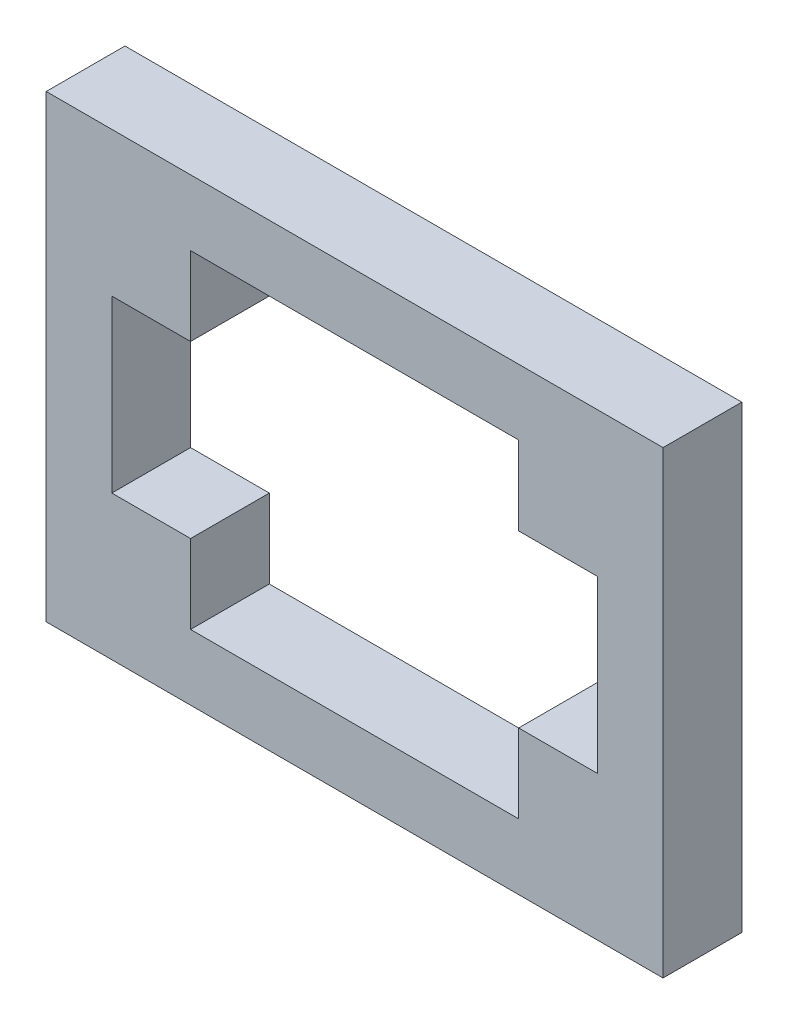
ISO-10303-21;
HEADER;
FILE_DESCRIPTION(('STEP AP214'),'2;1');
FILE_NAME('part.step','',(''),(''),'','','');
FILE_SCHEMA(('AUTOMOTIVE_DESIGN { 1 0 10303 214 1 1 1 1 }'));
ENDSEC;
DATA;
#1=APPLICATION_CONTEXT('core data for automotive mechanical design processes');
#2=APPLICATION_PROTOCOL_DEFINITION('international standard','automotive_design',2000,#1);
#3=PRODUCT_CONTEXT('',#1,'mechanical');
#4=PRODUCT('Part','Part','',(#3));
#5=PRODUCT_RELATED_PRODUCT_CATEGORY('part','',(#4));
#6=PRODUCT_DEFINITION_FORMATION('','',#4);
#7=PRODUCT_DEFINITION_CONTEXT('part definition',#1,'design');
#8=PRODUCT_DEFINITION('design','',#6,#7);
#9=PRODUCT_DEFINITION_SHAPE('','',#8);
#10=(LENGTH_UNIT() NAMED_UNIT(*) SI_UNIT(.MILLI.,.METRE.));
#11=(NAMED_UNIT(*) PLANE_ANGLE_UNIT() SI_UNIT($,.RADIAN.));
#12=(NAMED_UNIT(*) SI_UNIT($,.STERADIAN.) SOLID_ANGLE_UNIT());
#13=UNCERTAINTY_MEASURE_WITH_UNIT(LENGTH_MEASURE(1.E-05),#10,'distance_accuracy_value','');
#14=(GEOMETRIC_REPRESENTATION_CONTEXT(3) GLOBAL_UNCERTAINTY_ASSIGNED_CONTEXT((#13)) GLOBAL_UNIT_ASSIGNED_CONTEXT((#10,
#11,#12)) REPRESENTATION_CONTEXT('',''));
#15=CARTESIAN_POINT('',(0.,0.,0.));
#16=DIRECTION('',(0.,0.,1.));
#17=DIRECTION('',(1.,0.,0.));
#18=AXIS2_PLACEMENT_3D('',#15,#16,#17);
#19=CARTESIAN_POINT('',(0.,0.,6.));
#20=DIRECTION('',(0.,0.,-1.));
#21=DIRECTION('',(-1.,0.,0.));
#22=AXIS2_PLACEMENT_3D('',#19,#20,#21);
#23=PLANE('',#22);
#24=DIRECTION('',(0.,-1.,0.));
#25=VECTOR('',#24,1.);
#26=CARTESIAN_POINT('',(0.,0.,6.));
#27=LINE('',#26,#25);
#28=CARTESIAN_POINT('',(0.,35.,6.));
#29=VERTEX_POINT('',#28);
#30=CARTESIAN_POINT('',(0.,0.,6.));
#31=VERTEX_POINT('',#30);
#32=EDGE_CURVE('E282',#29,#31,#27,.T.);
#33=ORIENTED_EDGE('',*,*,#32,.T.);
#34=DIRECTION('',(1.,0.,0.));
#35=VECTOR('',#34,1.);
#36=CARTESIAN_POINT('',(0.,0.,6.));
#37=LINE('',#36,#35);
#38=CARTESIAN_POINT('',(47.,0.,6.));
#39=VERTEX_POINT('',#38);
#40=EDGE_CURVE('E286',#31,#39,#37,.T.);
#41=ORIENTED_EDGE('',*,*,#40,.T.);
#42=DIRECTION('',(0.,1.,0.));
#43=VECTOR('',#42,1.);
#44=CARTESIAN_POINT('',(47.,0.,6.));
#45=LINE('',#44,#43);
#46=CARTESIAN_POINT('',(47.,35.,6.));
#47=VERTEX_POINT('',#46);
#48=EDGE_CURVE('E290',#39,#47,#45,.T.);
#49=ORIENTED_EDGE('',*,*,#48,.T.);
#50=DIRECTION('',(-1.,0.,0.));
#51=VECTOR('',#50,1.);
#52=CARTESIAN_POINT('',(0.,35.,6.));
#53=LINE('',#52,#51);
#54=EDGE_CURVE('E293',#47,#29,#53,.T.);
#55=ORIENTED_EDGE('',*,*,#54,.T.);
#56=EDGE_LOOP('',(#33,#41,#49,#55));
#57=FACE_BOUND('',#56,.T.);
#58=DIRECTION('',(0.,-1.,0.));
#59=VECTOR('',#58,1.);
#60=CARTESIAN_POINT('',(11.,5.,6.));
#61=LINE('',#60,#59);
#62=CARTESIAN_POINT('',(11.,11.,6.));
#63=VERTEX_POINT('',#62);
#64=CARTESIAN_POINT('',(11.,5.,6.));
#65=VERTEX_POINT('',#64);
#66=EDGE_CURVE('E153',#63,#65,#61,.T.);
#67=ORIENTED_EDGE('',*,*,#66,.F.);
#68=DIRECTION('',(1.,0.,0.));
#69=VECTOR('',#68,1.);
#70=CARTESIAN_POINT('',(5.,11.,6.));
#71=LINE('',#70,#69);
#72=CARTESIAN_POINT('',(5.,11.,6.));
#73=VERTEX_POINT('',#72);
#74=EDGE_CURVE('E206',#73,#63,#71,.T.);
#75=ORIENTED_EDGE('',*,*,#74,.F.);
#76=DIRECTION('',(0.,-1.,0.));
#77=VECTOR('',#76,1.);
#78=CARTESIAN_POINT('',(5.,24.,6.));
#79=LINE('',#78,#77);
#80=CARTESIAN_POINT('',(5.,24.,6.));
#81=VERTEX_POINT('',#80);
#82=EDGE_CURVE('E203',#81,#73,#79,.T.);
#83=ORIENTED_EDGE('',*,*,#82,.F.);
#84=DIRECTION('',(-1.,0.,0.));
#85=VECTOR('',#84,1.);
#86=CARTESIAN_POINT('',(5.,24.,6.));
#87=LINE('',#86,#85);
#88=CARTESIAN_POINT('',(11.,24.,6.));
#89=VERTEX_POINT('',#88);
#90=EDGE_CURVE('E200',#89,#81,#87,.T.);
#91=ORIENTED_EDGE('',*,*,#90,.F.);
#92=DIRECTION('',(0.,-1.,0.));
#93=VECTOR('',#92,1.);
#94=CARTESIAN_POINT('',(11.,30.,6.));
#95=LINE('',#94,#93);
#96=CARTESIAN_POINT('',(11.,30.,6.));
#97=VERTEX_POINT('',#96);
#98=EDGE_CURVE('E197',#97,#89,#95,.T.);
#99=ORIENTED_EDGE('',*,*,#98,.F.);
#100=DIRECTION('',(-1.,0.,0.));
#101=VECTOR('',#100,1.);
#102=CARTESIAN_POINT('',(11.,30.,6.));
#103=LINE('',#102,#101);
#104=CARTESIAN_POINT('',(36.,30.,6.));
#105=VERTEX_POINT('',#104);
#106=EDGE_CURVE('E194',#105,#97,#103,.T.);
#107=ORIENTED_EDGE('',*,*,#106,.F.);
#108=DIRECTION('',(0.,1.,0.));
#109=VECTOR('',#108,1.);
#110=CARTESIAN_POINT('',(36.,30.,6.));
#111=LINE('',#110,#109);
#112=CARTESIAN_POINT('',(36.,24.,6.));
#113=VERTEX_POINT('',#112);
#114=EDGE_CURVE('E191',#113,#105,#111,.T.);
#115=ORIENTED_EDGE('',*,*,#114,.F.);
#116=DIRECTION('',(-1.,0.,0.));
#117=VECTOR('',#116,1.);
#118=CARTESIAN_POINT('',(42.,24.,6.));
#119=LINE('',#118,#117);
#120=CARTESIAN_POINT('',(42.,24.,6.));
#121=VERTEX_POINT('',#120);
#122=EDGE_CURVE('E188',#121,#113,#119,.T.);
#123=ORIENTED_EDGE('',*,*,#122,.F.);
#124=DIRECTION('',(0.,1.,0.));
#125=VECTOR('',#124,1.);
#126=CARTESIAN_POINT('',(42.,24.,6.));
#127=LINE('',#126,#125);
#128=CARTESIAN_POINT('',(42.,11.,6.));
#129=VERTEX_POINT('',#128);
#130=EDGE_CURVE('E185',#129,#121,#127,.T.);
#131=ORIENTED_EDGE('',*,*,#130,.F.);
#132=DIRECTION('',(1.,0.,0.));
#133=VECTOR('',#132,1.);
#134=CARTESIAN_POINT('',(42.,11.,6.));
#135=LINE('',#134,#133);
#136=CARTESIAN_POINT('',(36.,11.,6.));
#137=VERTEX_POINT('',#136);
#138=EDGE_CURVE('E180',#137,#129,#135,.T.);
#139=ORIENTED_EDGE('',*,*,#138,.F.);
#140=DIRECTION('',(0.,1.,0.));
#141=VECTOR('',#140,1.);
#142=CARTESIAN_POINT('',(36.,5.,6.));
#143=LINE('',#142,#141);
#144=CARTESIAN_POINT('',(36.,5.,6.));
#145=VERTEX_POINT('',#144);
#146=EDGE_CURVE('E176',#145,#137,#143,.T.);
#147=ORIENTED_EDGE('',*,*,#146,.F.);
#148=DIRECTION('',(1.,0.,0.));
#149=VECTOR('',#148,1.);
#150=CARTESIAN_POINT('',(11.,5.,6.));
#151=LINE('',#150,#149);
#152=EDGE_CURVE('E162',#65,#145,#151,.T.);
#153=ORIENTED_EDGE('',*,*,#152,.F.);
#154=EDGE_LOOP('',(#67,#75,#83,#91,#99,#107,#115,#123,#131,#139,#147,#153));
#155=FACE_BOUND('',#154,.T.);
#156=ADVANCED_FACE('F39',(#57,#155),#23,.F.);
#157=CARTESIAN_POINT('',(0.,0.,0.));
#158=DIRECTION('',(0.,0.,-1.));
#159=DIRECTION('',(-1.,0.,0.));
#160=AXIS2_PLACEMENT_3D('',#157,#158,#159);
#161=PLANE('',#160);
#162=DIRECTION('',(0.,-1.,0.));
#163=VECTOR('',#162,1.);
#164=CARTESIAN_POINT('',(0.,0.,0.));
#165=LINE('',#164,#163);
#166=CARTESIAN_POINT('',(0.,35.,0.));
#167=VERTEX_POINT('',#166);
#168=CARTESIAN_POINT('',(0.,0.,0.));
#169=VERTEX_POINT('',#168);
#170=EDGE_CURVE('E171',#167,#169,#165,.T.);
#171=ORIENTED_EDGE('',*,*,#170,.F.);
#172=DIRECTION('',(-1.,0.,0.));
#173=VECTOR('',#172,1.);
#174=CARTESIAN_POINT('',(0.,35.,0.));
#175=LINE('',#174,#173);
#176=CARTESIAN_POINT('',(47.,35.,0.));
#177=VERTEX_POINT('',#176);
#178=EDGE_CURVE('E287',#177,#167,#175,.T.);
#179=ORIENTED_EDGE('',*,*,#178,.F.);
#180=DIRECTION('',(0.,1.,0.));
#181=VECTOR('',#180,1.);
#182=CARTESIAN_POINT('',(47.,0.,0.));
#183=LINE('',#182,#181);
#184=CARTESIAN_POINT('',(47.,0.,0.));
#185=VERTEX_POINT('',#184);
#186=EDGE_CURVE('E303',#185,#177,#183,.T.);
#187=ORIENTED_EDGE('',*,*,#186,.F.);
#188=DIRECTION('',(1.,0.,0.));
#189=VECTOR('',#188,1.);
#190=CARTESIAN_POINT('',(0.,0.,0.));
#191=LINE('',#190,#189);
#192=EDGE_CURVE('E300',#169,#185,#191,.T.);
#193=ORIENTED_EDGE('',*,*,#192,.F.);
#194=EDGE_LOOP('',(#171,#179,#187,#193));
#195=FACE_BOUND('',#194,.T.);
#196=DIRECTION('',(1.,0.,0.));
#197=VECTOR('',#196,1.);
#198=CARTESIAN_POINT('',(5.,11.,0.));
#199=LINE('',#198,#197);
#200=CARTESIAN_POINT('',(5.,11.,0.));
#201=VERTEX_POINT('',#200);
#202=CARTESIAN_POINT('',(11.,11.,0.));
#203=VERTEX_POINT('',#202);
#204=EDGE_CURVE('E163',#201,#203,#199,.T.);
#205=ORIENTED_EDGE('',*,*,#204,.T.);
#206=DIRECTION('',(0.,-1.,0.));
#207=VECTOR('',#206,1.);
#208=CARTESIAN_POINT('',(11.,5.,0.));
#209=LINE('',#208,#207);
#210=CARTESIAN_POINT('',(11.,5.,0.));
#211=VERTEX_POINT('',#210);
#212=EDGE_CURVE('E63',#203,#211,#209,.T.);
#213=ORIENTED_EDGE('',*,*,#212,.T.);
#214=DIRECTION('',(1.,0.,0.));
#215=VECTOR('',#214,1.);
#216=CARTESIAN_POINT('',(11.,5.,0.));
#217=LINE('',#216,#215);
#218=CARTESIAN_POINT('',(36.,5.,0.));
#219=VERTEX_POINT('',#218);
#220=EDGE_CURVE('E169',#211,#219,#217,.T.);
#221=ORIENTED_EDGE('',*,*,#220,.T.);
#222=DIRECTION('',(0.,1.,0.));
#223=VECTOR('',#222,1.);
#224=CARTESIAN_POINT('',(36.,5.,0.));
#225=LINE('',#224,#223);
#226=CARTESIAN_POINT('',(36.,11.,0.));
#227=VERTEX_POINT('',#226);
#228=EDGE_CURVE('E213',#219,#227,#225,.T.);
#229=ORIENTED_EDGE('',*,*,#228,.T.);
#230=DIRECTION('',(1.,0.,0.));
#231=VECTOR('',#230,1.);
#232=CARTESIAN_POINT('',(42.,11.,0.));
#233=LINE('',#232,#231);
#234=CARTESIAN_POINT('',(42.,11.,0.));
#235=VERTEX_POINT('',#234);
#236=EDGE_CURVE('E217',#227,#235,#233,.T.);
#237=ORIENTED_EDGE('',*,*,#236,.T.);
#238=DIRECTION('',(0.,1.,0.));
#239=VECTOR('',#238,1.);
#240=CARTESIAN_POINT('',(42.,24.,0.));
#241=LINE('',#240,#239);
#242=CARTESIAN_POINT('',(42.,24.,0.));
#243=VERTEX_POINT('',#242);
#244=EDGE_CURVE('E221',#235,#243,#241,.T.);
#245=ORIENTED_EDGE('',*,*,#244,.T.);
#246=DIRECTION('',(-1.,0.,0.));
#247=VECTOR('',#246,1.);
#248=CARTESIAN_POINT('',(42.,24.,0.));
#249=LINE('',#248,#247);
#250=CARTESIAN_POINT('',(36.,24.,0.));
#251=VERTEX_POINT('',#250);
#252=EDGE_CURVE('E225',#243,#251,#249,.T.);
#253=ORIENTED_EDGE('',*,*,#252,.T.);
#254=DIRECTION('',(0.,1.,0.));
#255=VECTOR('',#254,1.);
#256=CARTESIAN_POINT('',(36.,30.,0.));
#257=LINE('',#256,#255);
#258=CARTESIAN_POINT('',(36.,30.,0.));
#259=VERTEX_POINT('',#258);
#260=EDGE_CURVE('E229',#251,#259,#257,.T.);
#261=ORIENTED_EDGE('',*,*,#260,.T.);
#262=DIRECTION('',(-1.,0.,0.));
#263=VECTOR('',#262,1.);
#264=CARTESIAN_POINT('',(11.,30.,0.));
#265=LINE('',#264,#263);
#266=CARTESIAN_POINT('',(11.,30.,0.));
#267=VERTEX_POINT('',#266);
#268=EDGE_CURVE('E233',#259,#267,#265,.T.);
#269=ORIENTED_EDGE('',*,*,#268,.T.);
#270=DIRECTION('',(0.,-1.,0.));
#271=VECTOR('',#270,1.);
#272=CARTESIAN_POINT('',(11.,30.,0.));
#273=LINE('',#272,#271);
#274=CARTESIAN_POINT('',(11.,24.,0.));
#275=VERTEX_POINT('',#274);
#276=EDGE_CURVE('E237',#267,#275,#273,.T.);
#277=ORIENTED_EDGE('',*,*,#276,.T.);
#278=DIRECTION('',(-1.,0.,0.));
#279=VECTOR('',#278,1.);
#280=CARTESIAN_POINT('',(5.,24.,0.));
#281=LINE('',#280,#279);
#282=CARTESIAN_POINT('',(5.,24.,0.));
#283=VERTEX_POINT('',#282);
#284=EDGE_CURVE('E241',#275,#283,#281,.T.);
#285=ORIENTED_EDGE('',*,*,#284,.T.);
#286=DIRECTION('',(0.,-1.,0.));
#287=VECTOR('',#286,1.);
#288=CARTESIAN_POINT('',(5.,24.,0.));
#289=LINE('',#288,#287);
#290=EDGE_CURVE('E245',#283,#201,#289,.T.);
#291=ORIENTED_EDGE('',*,*,#290,.T.);
#292=EDGE_LOOP('',(#205,#213,#221,#229,#237,#245,#253,#261,#269,#277,#285,#291));
#293=FACE_BOUND('',#292,.T.);
#294=ADVANCED_FACE('F326',(#195,#293),#161,.T.);
#295=CARTESIAN_POINT('',(0.,0.,6.));
#296=DIRECTION('',(1.,0.,0.));
#297=DIRECTION('',(0.,0.,-1.));
#298=AXIS2_PLACEMENT_3D('',#295,#296,#297);
#299=PLANE('',#298);
#300=ORIENTED_EDGE('',*,*,#170,.T.);
#301=DIRECTION('',(0.,0.,-1.));
#302=VECTOR('',#301,1.);
#303=CARTESIAN_POINT('',(0.,0.,6.));
#304=LINE('',#303,#302);
#305=EDGE_CURVE('E11',#31,#169,#304,.T.);
#306=ORIENTED_EDGE('',*,*,#305,.F.);
#307=ORIENTED_EDGE('',*,*,#32,.F.);
#308=DIRECTION('',(0.,0.,-1.));
#309=VECTOR('',#308,1.);
#310=CARTESIAN_POINT('',(0.,35.,6.));
#311=LINE('',#310,#309);
#312=EDGE_CURVE('E296',#29,#167,#311,.T.);
#313=ORIENTED_EDGE('',*,*,#312,.T.);
#314=EDGE_LOOP('',(#300,#306,#307,#313));
#315=FACE_BOUND('',#314,.T.);
#316=ADVANCED_FACE('F41',(#315),#299,.F.);
#317=CARTESIAN_POINT('',(0.,0.,6.));
#318=DIRECTION('',(0.,1.,0.));
#319=DIRECTION('',(0.,0.,1.));
#320=AXIS2_PLACEMENT_3D('',#317,#318,#319);
#321=PLANE('',#320);
#322=ORIENTED_EDGE('',*,*,#192,.T.);
#323=DIRECTION('',(0.,0.,-1.));
#324=VECTOR('',#323,1.);
#325=CARTESIAN_POINT('',(47.,0.,6.));
#326=LINE('',#325,#324);
#327=EDGE_CURVE('E48',#39,#185,#326,.T.);
#328=ORIENTED_EDGE('',*,*,#327,.F.);
#329=ORIENTED_EDGE('',*,*,#40,.F.);
#330=ORIENTED_EDGE('',*,*,#305,.T.);
#331=EDGE_LOOP('',(#322,#328,#329,#330));
#332=FACE_BOUND('',#331,.T.);
#333=ADVANCED_FACE('F336',(#332),#321,.F.);
#334=CARTESIAN_POINT('',(47.,0.,6.));
#335=DIRECTION('',(-1.,0.,0.));
#336=DIRECTION('',(0.,0.,1.));
#337=AXIS2_PLACEMENT_3D('',#334,#335,#336);
#338=PLANE('',#337);
#339=ORIENTED_EDGE('',*,*,#186,.T.);
#340=DIRECTION('',(0.,0.,-1.));
#341=VECTOR('',#340,1.);
#342=CARTESIAN_POINT('',(47.,35.,6.));
#343=LINE('',#342,#341);
#344=EDGE_CURVE('E311',#47,#177,#343,.T.);
#345=ORIENTED_EDGE('',*,*,#344,.F.);
#346=ORIENTED_EDGE('',*,*,#48,.F.);
#347=ORIENTED_EDGE('',*,*,#327,.T.);
#348=EDGE_LOOP('',(#339,#345,#346,#347));
#349=FACE_BOUND('',#348,.T.);
#350=ADVANCED_FACE('F320',(#349),#338,.F.);
#351=CARTESIAN_POINT('',(0.,35.,6.));
#352=DIRECTION('',(0.,-1.,0.));
#353=DIRECTION('',(0.,0.,-1.));
#354=AXIS2_PLACEMENT_3D('',#351,#352,#353);
#355=PLANE('',#354);
#356=ORIENTED_EDGE('',*,*,#178,.T.);
#357=ORIENTED_EDGE('',*,*,#312,.F.);
#358=ORIENTED_EDGE('',*,*,#54,.F.);
#359=ORIENTED_EDGE('',*,*,#344,.T.);
#360=EDGE_LOOP('',(#356,#357,#358,#359));
#361=FACE_BOUND('',#360,.T.);
#362=ADVANCED_FACE('F330',(#361),#355,.F.);
#363=CARTESIAN_POINT('',(11.,5.,6.));
#364=DIRECTION('',(1.,0.,0.));
#365=DIRECTION('',(0.,0.,-1.));
#366=AXIS2_PLACEMENT_3D('',#363,#364,#365);
#367=PLANE('',#366);
#368=ORIENTED_EDGE('',*,*,#212,.F.);
#369=DIRECTION('',(0.,0.,-1.));
#370=VECTOR('',#369,1.);
#371=CARTESIAN_POINT('',(11.,11.,6.));
#372=LINE('',#371,#370);
#373=EDGE_CURVE('E157',#63,#203,#372,.T.);
#374=ORIENTED_EDGE('',*,*,#373,.F.);
#375=ORIENTED_EDGE('',*,*,#66,.T.);
#376=DIRECTION('',(0.,0.,-1.));
#377=VECTOR('',#376,1.);
#378=CARTESIAN_POINT('',(11.,5.,6.));
#379=LINE('',#378,#377);
#380=EDGE_CURVE('E156',#65,#211,#379,.T.);
#381=ORIENTED_EDGE('',*,*,#380,.T.);
#382=EDGE_LOOP('',(#368,#374,#375,#381));
#383=FACE_BOUND('',#382,.T.);
#384=ADVANCED_FACE('F155',(#383),#367,.T.);
#385=CARTESIAN_POINT('',(11.,5.,6.));
#386=DIRECTION('',(0.,1.,0.));
#387=DIRECTION('',(0.,0.,1.));
#388=AXIS2_PLACEMENT_3D('',#385,#386,#387);
#389=PLANE('',#388);
#390=ORIENTED_EDGE('',*,*,#220,.F.);
#391=ORIENTED_EDGE('',*,*,#380,.F.);
#392=ORIENTED_EDGE('',*,*,#152,.T.);
#393=DIRECTION('',(0.,0.,-1.));
#394=VECTOR('',#393,1.);
#395=CARTESIAN_POINT('',(36.,5.,6.));
#396=LINE('',#395,#394);
#397=EDGE_CURVE('E172',#145,#219,#396,.T.);
#398=ORIENTED_EDGE('',*,*,#397,.T.);
#399=EDGE_LOOP('',(#390,#391,#392,#398));
#400=FACE_BOUND('',#399,.T.);
#401=ADVANCED_FACE('F166',(#400),#389,.T.);
#402=CARTESIAN_POINT('',(36.,5.,6.));
#403=DIRECTION('',(-1.,0.,0.));
#404=DIRECTION('',(0.,0.,1.));
#405=AXIS2_PLACEMENT_3D('',#402,#403,#404);
#406=PLANE('',#405);
#407=ORIENTED_EDGE('',*,*,#228,.F.);
#408=ORIENTED_EDGE('',*,*,#397,.F.);
#409=ORIENTED_EDGE('',*,*,#146,.T.);
#410=DIRECTION('',(0.,0.,-1.));
#411=VECTOR('',#410,1.);
#412=CARTESIAN_POINT('',(36.,11.,6.));
#413=LINE('',#412,#411);
#414=EDGE_CURVE('E277',#137,#227,#413,.T.);
#415=ORIENTED_EDGE('',*,*,#414,.T.);
#416=EDGE_LOOP('',(#407,#408,#409,#415));
#417=FACE_BOUND('',#416,.T.);
#418=ADVANCED_FACE('F359',(#417),#406,.T.);
#419=CARTESIAN_POINT('',(42.,11.,6.));
#420=DIRECTION('',(0.,1.,0.));
#421=DIRECTION('',(-1.,0.,0.));
#422=AXIS2_PLACEMENT_3D('',#419,#420,#421);
#423=PLANE('',#422);
#424=ORIENTED_EDGE('',*,*,#236,.F.);
#425=ORIENTED_EDGE('',*,*,#414,.F.);
#426=ORIENTED_EDGE('',*,*,#138,.T.);
#427=DIRECTION('',(0.,0.,-1.));
#428=VECTOR('',#427,1.);
#429=CARTESIAN_POINT('',(42.,11.,6.));
#430=LINE('',#429,#428);
#431=EDGE_CURVE('E274',#129,#235,#430,.T.);
#432=ORIENTED_EDGE('',*,*,#431,.T.);
#433=EDGE_LOOP('',(#424,#425,#426,#432));
#434=FACE_BOUND('',#433,.T.);
#435=ADVANCED_FACE('F363',(#434),#423,.T.);
#436=CARTESIAN_POINT('',(42.,24.,6.));
#437=DIRECTION('',(-1.,0.,0.));
#438=DIRECTION('',(0.,-1.,0.));
#439=AXIS2_PLACEMENT_3D('',#436,#437,#438);
#440=PLANE('',#439);
#441=ORIENTED_EDGE('',*,*,#244,.F.);
#442=ORIENTED_EDGE('',*,*,#431,.F.);
#443=ORIENTED_EDGE('',*,*,#130,.T.);
#444=DIRECTION('',(0.,0.,-1.));
#445=VECTOR('',#444,1.);
#446=CARTESIAN_POINT('',(42.,24.,6.));
#447=LINE('',#446,#445);
#448=EDGE_CURVE('E271',#121,#243,#447,.T.);
#449=ORIENTED_EDGE('',*,*,#448,.T.);
#450=EDGE_LOOP('',(#441,#442,#443,#449));
#451=FACE_BOUND('',#450,.T.);
#452=ADVANCED_FACE('F369',(#451),#440,.T.);
#453=CARTESIAN_POINT('',(42.,24.,6.));
#454=DIRECTION('',(0.,-1.,0.));
#455=DIRECTION('',(0.,0.,-1.));
#456=AXIS2_PLACEMENT_3D('',#453,#454,#455);
#457=PLANE('',#456);
#458=ORIENTED_EDGE('',*,*,#252,.F.);
#459=ORIENTED_EDGE('',*,*,#448,.F.);
#460=ORIENTED_EDGE('',*,*,#122,.T.);
#461=DIRECTION('',(0.,0.,-1.));
#462=VECTOR('',#461,1.);
#463=CARTESIAN_POINT('',(36.,24.,6.));
#464=LINE('',#463,#462);
#465=EDGE_CURVE('E268',#113,#251,#464,.T.);
#466=ORIENTED_EDGE('',*,*,#465,.T.);
#467=EDGE_LOOP('',(#458,#459,#460,#466));
#468=FACE_BOUND('',#467,.T.);
#469=ADVANCED_FACE('F373',(#468),#457,.T.);
#470=CARTESIAN_POINT('',(36.,30.,6.));
#471=DIRECTION('',(-1.,0.,0.));
#472=DIRECTION('',(0.,0.,1.));
#473=AXIS2_PLACEMENT_3D('',#470,#471,#472);
#474=PLANE('',#473);
#475=ORIENTED_EDGE('',*,*,#260,.F.);
#476=ORIENTED_EDGE('',*,*,#465,.F.);
#477=ORIENTED_EDGE('',*,*,#114,.T.);
#478=DIRECTION('',(0.,0.,-1.));
#479=VECTOR('',#478,1.);
#480=CARTESIAN_POINT('',(36.,30.,6.));
#481=LINE('',#480,#479);
#482=EDGE_CURVE('E265',#105,#259,#481,.T.);
#483=ORIENTED_EDGE('',*,*,#482,.T.);
#484=EDGE_LOOP('',(#475,#476,#477,#483));
#485=FACE_BOUND('',#484,.T.);
#486=ADVANCED_FACE('F377',(#485),#474,.T.);
#487=CARTESIAN_POINT('',(11.,30.,6.));
#488=DIRECTION('',(0.,-1.,0.));
#489=DIRECTION('',(0.,0.,-1.));
#490=AXIS2_PLACEMENT_3D('',#487,#488,#489);
#491=PLANE('',#490);
#492=ORIENTED_EDGE('',*,*,#268,.F.);
#493=ORIENTED_EDGE('',*,*,#482,.F.);
#494=ORIENTED_EDGE('',*,*,#106,.T.);
#495=DIRECTION('',(0.,0.,-1.));
#496=VECTOR('',#495,1.);
#497=CARTESIAN_POINT('',(11.,30.,6.));
#498=LINE('',#497,#496);
#499=EDGE_CURVE('E262',#97,#267,#498,.T.);
#500=ORIENTED_EDGE('',*,*,#499,.T.);
#501=EDGE_LOOP('',(#492,#493,#494,#500));
#502=FACE_BOUND('',#501,.T.);
#503=ADVANCED_FACE('F381',(#502),#491,.T.);
#504=CARTESIAN_POINT('',(11.,30.,6.));
#505=DIRECTION('',(1.,0.,0.));
#506=DIRECTION('',(0.,0.,-1.));
#507=AXIS2_PLACEMENT_3D('',#504,#505,#506);
#508=PLANE('',#507);
#509=ORIENTED_EDGE('',*,*,#276,.F.);
#510=ORIENTED_EDGE('',*,*,#499,.F.);
#511=ORIENTED_EDGE('',*,*,#98,.T.);
#512=DIRECTION('',(0.,0.,-1.));
#513=VECTOR('',#512,1.);
#514=CARTESIAN_POINT('',(11.,24.,6.));
#515=LINE('',#514,#513);
#516=EDGE_CURVE('E259',#89,#275,#515,.T.);
#517=ORIENTED_EDGE('',*,*,#516,.T.);
#518=EDGE_LOOP('',(#509,#510,#511,#517));
#519=FACE_BOUND('',#518,.T.);
#520=ADVANCED_FACE('F385',(#519),#508,.T.);
#521=CARTESIAN_POINT('',(5.,24.,6.));
#522=DIRECTION('',(0.,-1.,0.));
#523=DIRECTION('',(0.,0.,-1.));
#524=AXIS2_PLACEMENT_3D('',#521,#522,#523);
#525=PLANE('',#524);
#526=ORIENTED_EDGE('',*,*,#284,.F.);
#527=ORIENTED_EDGE('',*,*,#516,.F.);
#528=ORIENTED_EDGE('',*,*,#90,.T.);
#529=DIRECTION('',(0.,0.,-1.));
#530=VECTOR('',#529,1.);
#531=CARTESIAN_POINT('',(5.,24.,6.));
#532=LINE('',#531,#530);
#533=EDGE_CURVE('E256',#81,#283,#532,.T.);
#534=ORIENTED_EDGE('',*,*,#533,.T.);
#535=EDGE_LOOP('',(#526,#527,#528,#534));
#536=FACE_BOUND('',#535,.T.);
#537=ADVANCED_FACE('F389',(#536),#525,.T.);
#538=CARTESIAN_POINT('',(5.,24.,6.));
#539=DIRECTION('',(1.,0.,0.));
#540=DIRECTION('',(0.,1.,0.));
#541=AXIS2_PLACEMENT_3D('',#538,#539,#540);
#542=PLANE('',#541);
#543=ORIENTED_EDGE('',*,*,#290,.F.);
#544=ORIENTED_EDGE('',*,*,#533,.F.);
#545=ORIENTED_EDGE('',*,*,#82,.T.);
#546=DIRECTION('',(0.,0.,-1.));
#547=VECTOR('',#546,1.);
#548=CARTESIAN_POINT('',(5.,11.,6.));
#549=LINE('',#548,#547);
#550=EDGE_CURVE('E55',#73,#201,#549,.T.);
#551=ORIENTED_EDGE('',*,*,#550,.T.);
#552=EDGE_LOOP('',(#543,#544,#545,#551));
#553=FACE_BOUND('',#552,.T.);
#554=ADVANCED_FACE('F393',(#553),#542,.T.);
#555=CARTESIAN_POINT('',(5.,11.,6.));
#556=DIRECTION('',(0.,1.,0.));
#557=DIRECTION('',(-1.,0.,0.));
#558=AXIS2_PLACEMENT_3D('',#555,#556,#557);
#559=PLANE('',#558);
#560=ORIENTED_EDGE('',*,*,#204,.F.);
#561=ORIENTED_EDGE('',*,*,#550,.F.);
#562=ORIENTED_EDGE('',*,*,#74,.T.);
#563=ORIENTED_EDGE('',*,*,#373,.T.);
#564=EDGE_LOOP('',(#560,#561,#562,#563));
#565=FACE_BOUND('',#564,.T.);
#566=ADVANCED_FACE('F397',(#565),#559,.T.);
#567=CLOSED_SHELL('',(#156,#294,#316,#333,#350,#362,#384,#401,#418,#435,#452,#469,#486,#503,
#520,#537,#554,#566));
#568=MANIFOLD_SOLID_BREP('B2',#567);
#569=ADVANCED_BREP_SHAPE_REPRESENTATION('',(#18,#568),#14);
#570=SHAPE_DEFINITION_REPRESENTATION(#9,#569);
ENDSEC;
END-ISO-10303-21;
